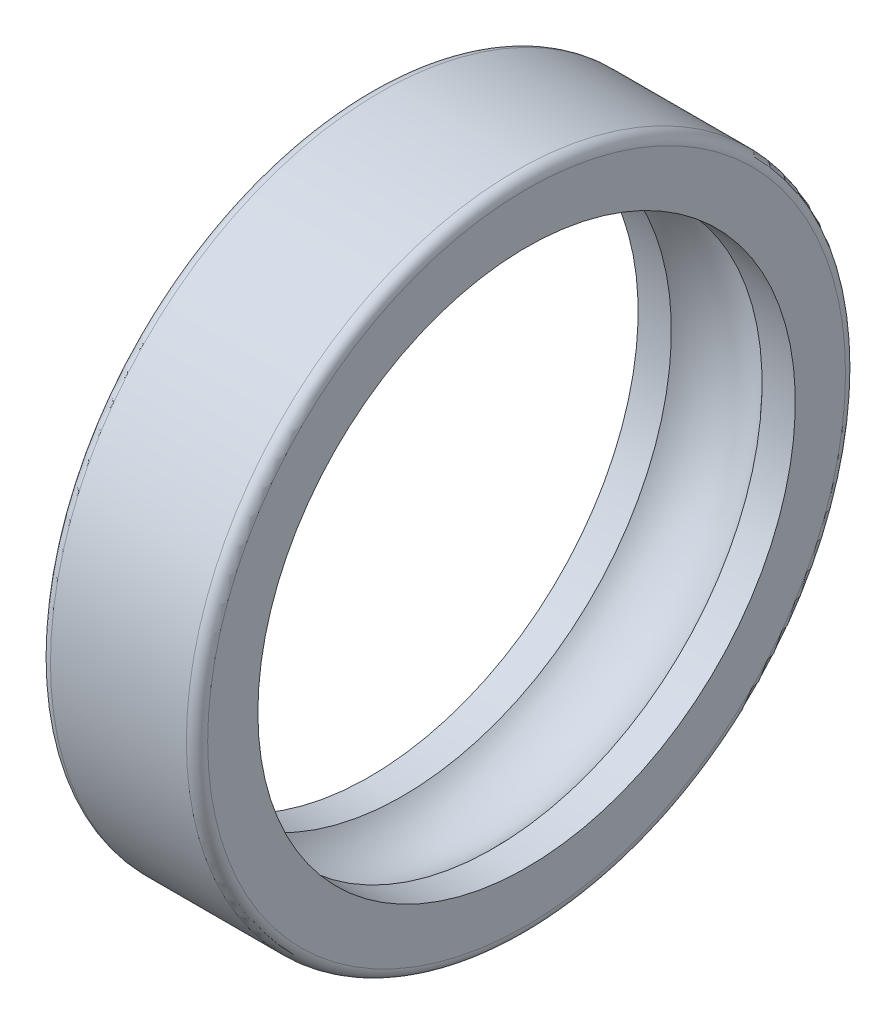
ISO-10303-21;
HEADER;
FILE_DESCRIPTION(('STEP AP214'),'2;1');
FILE_NAME('part.step','',(''),(''),'','','');
FILE_SCHEMA(('AUTOMOTIVE_DESIGN { 1 0 10303 214 1 1 1 1 }'));
ENDSEC;
DATA;
#1=APPLICATION_CONTEXT('core data for automotive mechanical design processes');
#2=APPLICATION_PROTOCOL_DEFINITION('international standard','automotive_design',2000,#1);
#3=PRODUCT_CONTEXT('',#1,'mechanical');
#4=PRODUCT('Part','Part','',(#3));
#5=PRODUCT_RELATED_PRODUCT_CATEGORY('part','',(#4));
#6=PRODUCT_DEFINITION_FORMATION('','',#4);
#7=PRODUCT_DEFINITION_CONTEXT('part definition',#1,'design');
#8=PRODUCT_DEFINITION('design','',#6,#7);
#9=PRODUCT_DEFINITION_SHAPE('','',#8);
#10=(LENGTH_UNIT() NAMED_UNIT(*) SI_UNIT(.MILLI.,.METRE.));
#11=(NAMED_UNIT(*) PLANE_ANGLE_UNIT() SI_UNIT($,.RADIAN.));
#12=(NAMED_UNIT(*) SI_UNIT($,.STERADIAN.) SOLID_ANGLE_UNIT());
#13=UNCERTAINTY_MEASURE_WITH_UNIT(LENGTH_MEASURE(1.E-05),#10,'distance_accuracy_value','');
#14=(GEOMETRIC_REPRESENTATION_CONTEXT(3) GLOBAL_UNCERTAINTY_ASSIGNED_CONTEXT((#13)) GLOBAL_UNIT_ASSIGNED_CONTEXT((#10,
#11,#12)) REPRESENTATION_CONTEXT('',''));
#15=CARTESIAN_POINT('',(0.,0.,0.));
#16=DIRECTION('',(0.,0.,1.));
#17=DIRECTION('',(1.,0.,0.));
#18=AXIS2_PLACEMENT_3D('',#15,#16,#17);
#19=CARTESIAN_POINT('',(15.5,65.,0.));
#20=DIRECTION('',(-1.,0.,0.));
#21=DIRECTION('',(0.,0.,1.));
#22=AXIS2_PLACEMENT_3D('',#19,#20,#21);
#23=PLANE('',#22);
#24=CARTESIAN_POINT('',(15.5,0.,0.));
#25=DIRECTION('',(-1.,0.,0.));
#26=DIRECTION('',(0.,0.,1.));
#27=AXIS2_PLACEMENT_3D('',#24,#25,#26);
#28=CIRCLE('',#27,62.9);
#29=CARTESIAN_POINT('',(15.5,0.,62.9));
#30=VERTEX_POINT('',#29);
#31=EDGE_CURVE('E45',#30,#30,#28,.F.);
#32=ORIENTED_EDGE('',*,*,#31,.T.);
#33=EDGE_LOOP('',(#32));
#34=FACE_BOUND('',#33,.T.);
#35=CARTESIAN_POINT('',(15.5,0.,0.));
#36=DIRECTION('',(-1.,0.,0.));
#37=DIRECTION('',(0.,0.,1.));
#38=AXIS2_PLACEMENT_3D('',#35,#36,#37);
#39=CIRCLE('',#38,53.);
#40=CARTESIAN_POINT('',(15.5,0.,53.));
#41=VERTEX_POINT('',#40);
#42=EDGE_CURVE('E61',#41,#41,#39,.T.);
#43=ORIENTED_EDGE('',*,*,#42,.T.);
#44=EDGE_LOOP('',(#43));
#45=FACE_BOUND('',#44,.T.);
#46=ADVANCED_FACE('F37',(#34,#45),#23,.F.);
#47=CARTESIAN_POINT('',(-15.5,0.,0.));
#48=DIRECTION('',(-1.,0.,0.));
#49=DIRECTION('',(0.,0.,1.));
#50=AXIS2_PLACEMENT_3D('',#47,#48,#49);
#51=CYLINDRICAL_SURFACE('',#50,53.);
#52=ORIENTED_EDGE('',*,*,#42,.F.);
#53=EDGE_LOOP('',(#52));
#54=FACE_BOUND('',#53,.T.);
#55=CARTESIAN_POINT('',(8.94427190999916,0.,0.));
#56=DIRECTION('',(-1.,0.,0.));
#57=DIRECTION('',(0.,0.,1.));
#58=AXIS2_PLACEMENT_3D('',#55,#56,#57);
#59=CIRCLE('',#58,53.);
#60=CARTESIAN_POINT('',(8.94427190999916,0.,53.));
#61=VERTEX_POINT('',#60);
#62=EDGE_CURVE('E65',#61,#61,#59,.T.);
#63=ORIENTED_EDGE('',*,*,#62,.T.);
#64=EDGE_LOOP('',(#63));
#65=FACE_BOUND('',#64,.T.);
#66=ADVANCED_FACE('F95',(#54,#65),#51,.F.);
#67=CARTESIAN_POINT('',(0.,0.,0.));
#68=DIRECTION('',(-1.,0.,0.));
#69=DIRECTION('',(0.,0.,1.));
#70=AXIS2_PLACEMENT_3D('',#67,#68,#69);
#71=TOROIDAL_SURFACE('',#70,45.,12.);
#72=ORIENTED_EDGE('',*,*,#62,.F.);
#73=EDGE_LOOP('',(#72));
#74=FACE_BOUND('',#73,.T.);
#75=CARTESIAN_POINT('',(-8.94427190999916,0.,0.));
#76=DIRECTION('',(-1.,0.,0.));
#77=DIRECTION('',(0.,0.,1.));
#78=AXIS2_PLACEMENT_3D('',#75,#76,#77);
#79=CIRCLE('',#78,53.);
#80=CARTESIAN_POINT('',(-8.94427190999916,0.,53.));
#81=VERTEX_POINT('',#80);
#82=EDGE_CURVE('E69',#81,#81,#79,.T.);
#83=ORIENTED_EDGE('',*,*,#82,.T.);
#84=EDGE_LOOP('',(#83));
#85=FACE_BOUND('',#84,.T.);
#86=ADVANCED_FACE('F91',(#74,#85),#71,.F.);
#87=CARTESIAN_POINT('',(-15.5,0.,0.));
#88=DIRECTION('',(-1.,0.,0.));
#89=DIRECTION('',(0.,0.,1.));
#90=AXIS2_PLACEMENT_3D('',#87,#88,#89);
#91=CYLINDRICAL_SURFACE('',#90,53.);
#92=ORIENTED_EDGE('',*,*,#82,.F.);
#93=EDGE_LOOP('',(#92));
#94=FACE_BOUND('',#93,.T.);
#95=CARTESIAN_POINT('',(-15.5,0.,0.));
#96=DIRECTION('',(-1.,0.,0.));
#97=DIRECTION('',(0.,0.,1.));
#98=AXIS2_PLACEMENT_3D('',#95,#96,#97);
#99=CIRCLE('',#98,53.);
#100=CARTESIAN_POINT('',(-15.5,0.,53.));
#101=VERTEX_POINT('',#100);
#102=EDGE_CURVE('E73',#101,#101,#99,.T.);
#103=ORIENTED_EDGE('',*,*,#102,.T.);
#104=EDGE_LOOP('',(#103));
#105=FACE_BOUND('',#104,.T.);
#106=ADVANCED_FACE('F78',(#94,#105),#91,.F.);
#107=CARTESIAN_POINT('',(-15.5,65.,0.));
#108=DIRECTION('',(1.,0.,0.));
#109=DIRECTION('',(0.,0.,-1.));
#110=AXIS2_PLACEMENT_3D('',#107,#108,#109);
#111=PLANE('',#110);
#112=CARTESIAN_POINT('',(-15.5,0.,0.));
#113=DIRECTION('',(1.,0.,0.));
#114=DIRECTION('',(0.,0.,-1.));
#115=AXIS2_PLACEMENT_3D('',#112,#113,#114);
#116=CIRCLE('',#115,62.9);
#117=CARTESIAN_POINT('',(-15.5,0.,-62.9));
#118=VERTEX_POINT('',#117);
#119=EDGE_CURVE('E10',#118,#118,#116,.F.);
#120=ORIENTED_EDGE('',*,*,#119,.T.);
#121=EDGE_LOOP('',(#120));
#122=FACE_BOUND('',#121,.T.);
#123=ORIENTED_EDGE('',*,*,#102,.F.);
#124=EDGE_LOOP('',(#123));
#125=FACE_BOUND('',#124,.T.);
#126=ADVANCED_FACE('F80',(#122,#125),#111,.F.);
#127=CARTESIAN_POINT('',(-15.5,0.,0.));
#128=DIRECTION('',(-1.,0.,0.));
#129=DIRECTION('',(0.,0.,1.));
#130=AXIS2_PLACEMENT_3D('',#127,#128,#129);
#131=CYLINDRICAL_SURFACE('',#130,65.);
#132=CARTESIAN_POINT('',(13.4,0.,0.));
#133=DIRECTION('',(-1.,0.,0.));
#134=DIRECTION('',(0.,0.,1.));
#135=AXIS2_PLACEMENT_3D('',#132,#133,#134);
#136=CIRCLE('',#135,65.);
#137=CARTESIAN_POINT('',(13.4,0.,65.));
#138=VERTEX_POINT('',#137);
#139=EDGE_CURVE('E50',#138,#138,#136,.T.);
#140=ORIENTED_EDGE('',*,*,#139,.T.);
#141=EDGE_LOOP('',(#140));
#142=FACE_BOUND('',#141,.T.);
#143=CARTESIAN_POINT('',(-13.4,0.,0.));
#144=DIRECTION('',(1.,0.,0.));
#145=DIRECTION('',(0.,0.,-1.));
#146=AXIS2_PLACEMENT_3D('',#143,#144,#145);
#147=CIRCLE('',#146,65.);
#148=CARTESIAN_POINT('',(-13.4,0.,-65.));
#149=VERTEX_POINT('',#148);
#150=EDGE_CURVE('E55',#149,#149,#147,.T.);
#151=ORIENTED_EDGE('',*,*,#150,.T.);
#152=EDGE_LOOP('',(#151));
#153=FACE_BOUND('',#152,.T.);
#154=ADVANCED_FACE('F82',(#142,#153),#131,.T.);
#155=CARTESIAN_POINT('',(13.4,0.,0.));
#156=DIRECTION('',(-1.,0.,0.));
#157=DIRECTION('',(0.,0.,1.));
#158=AXIS2_PLACEMENT_3D('',#155,#156,#157);
#159=TOROIDAL_SURFACE('',#158,62.9,2.1);
#160=ORIENTED_EDGE('',*,*,#31,.F.);
#161=EDGE_LOOP('',(#160));
#162=FACE_BOUND('',#161,.T.);
#163=ORIENTED_EDGE('',*,*,#139,.F.);
#164=EDGE_LOOP('',(#163));
#165=FACE_BOUND('',#164,.T.);
#166=ADVANCED_FACE('F88',(#162,#165),#159,.T.);
#167=CARTESIAN_POINT('',(-13.4,0.,0.));
#168=DIRECTION('',(1.,0.,0.));
#169=DIRECTION('',(0.,0.,-1.));
#170=AXIS2_PLACEMENT_3D('',#167,#168,#169);
#171=TOROIDAL_SURFACE('',#170,62.9,2.1);
#172=ORIENTED_EDGE('',*,*,#150,.F.);
#173=EDGE_LOOP('',(#172));
#174=FACE_BOUND('',#173,.T.);
#175=ORIENTED_EDGE('',*,*,#119,.F.);
#176=EDGE_LOOP('',(#175));
#177=FACE_BOUND('',#176,.T.);
#178=ADVANCED_FACE('F39',(#174,#177),#171,.T.);
#179=CLOSED_SHELL('',(#46,#66,#86,#106,#126,#154,#166,#178));
#180=MANIFOLD_SOLID_BREP('B2',#179);
#181=ADVANCED_BREP_SHAPE_REPRESENTATION('',(#18,#180),#14);
#182=SHAPE_DEFINITION_REPRESENTATION(#9,#181);
ENDSEC;
END-ISO-10303-21;
